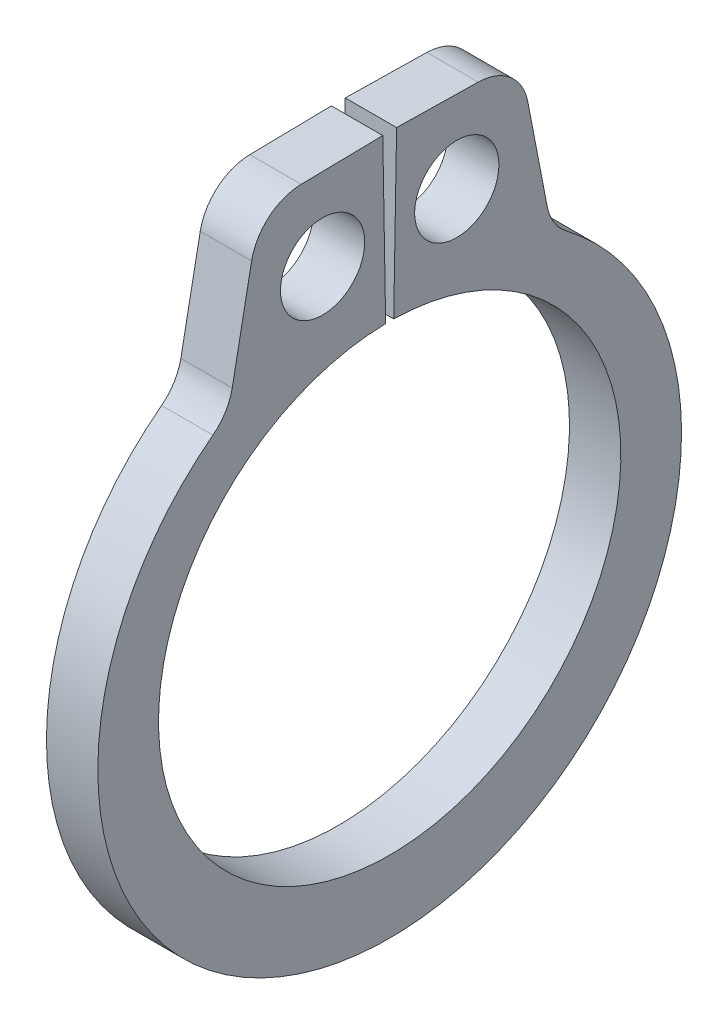
ISO-10303-21;
HEADER;
FILE_DESCRIPTION(('STEP AP214'),'2;1');
FILE_NAME('part.step','',(''),(''),'','','');
FILE_SCHEMA(('AUTOMOTIVE_DESIGN { 1 0 10303 214 1 1 1 1 }'));
ENDSEC;
DATA;
#1=APPLICATION_CONTEXT('core data for automotive mechanical design processes');
#2=APPLICATION_PROTOCOL_DEFINITION('international standard','automotive_design',2000,#1);
#3=PRODUCT_CONTEXT('',#1,'mechanical');
#4=PRODUCT('Part','Part','',(#3));
#5=PRODUCT_RELATED_PRODUCT_CATEGORY('part','',(#4));
#6=PRODUCT_DEFINITION_FORMATION('','',#4);
#7=PRODUCT_DEFINITION_CONTEXT('part definition',#1,'design');
#8=PRODUCT_DEFINITION('design','',#6,#7);
#9=PRODUCT_DEFINITION_SHAPE('','',#8);
#10=(LENGTH_UNIT() NAMED_UNIT(*) SI_UNIT(.MILLI.,.METRE.));
#11=(NAMED_UNIT(*) PLANE_ANGLE_UNIT() SI_UNIT($,.RADIAN.));
#12=(NAMED_UNIT(*) SI_UNIT($,.STERADIAN.) SOLID_ANGLE_UNIT());
#13=UNCERTAINTY_MEASURE_WITH_UNIT(LENGTH_MEASURE(1.E-05),#10,'distance_accuracy_value','');
#14=(GEOMETRIC_REPRESENTATION_CONTEXT(3) GLOBAL_UNCERTAINTY_ASSIGNED_CONTEXT((#13)) GLOBAL_UNIT_ASSIGNED_CONTEXT((#10,
#11,#12)) REPRESENTATION_CONTEXT('',''));
#15=CARTESIAN_POINT('',(0.,0.,0.));
#16=DIRECTION('',(0.,0.,1.));
#17=DIRECTION('',(1.,0.,0.));
#18=AXIS2_PLACEMENT_3D('',#15,#16,#17);
#19=CARTESIAN_POINT('',(0.3175,0.,0.));
#20=DIRECTION('',(1.,0.,0.));
#21=DIRECTION('',(0.,0.,-1.));
#22=AXIS2_PLACEMENT_3D('',#19,#20,#21);
#23=PLANE('',#22);
#24=CARTESIAN_POINT('',(0.3175,3.85961131348306,0.829485840043991));
#25=DIRECTION('',(1.,0.,0.));
#26=DIRECTION('',(0.,0.,-1.));
#27=AXIS2_PLACEMENT_3D('',#24,#25,#26);
#28=CIRCLE('',#27,0.5207);
#29=CARTESIAN_POINT('',(0.3175,3.85961131348306,0.308785840043991));
#30=VERTEX_POINT('',#29);
#31=EDGE_CURVE('E224',#30,#30,#28,.T.);
#32=ORIENTED_EDGE('',*,*,#31,.F.);
#33=EDGE_LOOP('',(#32));
#34=FACE_BOUND('',#33,.T.);
#35=DIRECTION('',(0.,-0.017452406437292,0.999847695156391));
#36=VECTOR('',#35,1.);
#37=CARTESIAN_POINT('',(0.3175,4.88875530546717,0.085333541275098));
#38=LINE('',#37,#36);
#39=CARTESIAN_POINT('',(0.3175,4.88875530546717,0.085333541275098));
#40=VERTEX_POINT('',#39);
#41=CARTESIAN_POINT('',(0.3175,4.87114314790031,1.09433337251507));
#42=VERTEX_POINT('',#41);
#43=EDGE_CURVE('E136',#40,#42,#38,.T.);
#44=ORIENTED_EDGE('',*,*,#43,.T.);
#45=CARTESIAN_POINT('',(0.3175,4.236239861476,1.08325109442739));
#46=DIRECTION('',(1.,0.,0.));
#47=DIRECTION('',(0.,0.,-1.));
#48=AXIS2_PLACEMENT_3D('',#45,#46,#47);
#49=CIRCLE('',#48,0.635);
#50=CARTESIAN_POINT('',(0.3175,4.35665257048609,1.7067298667275));
#51=VERTEX_POINT('',#50);
#52=EDGE_CURVE('E177',#42,#51,#49,.T.);
#53=ORIENTED_EDGE('',*,*,#52,.T.);
#54=DIRECTION('',(0.,-0.981856334330881,0.189626313401717));
#55=VECTOR('',#54,1.);
#56=CARTESIAN_POINT('',(0.3175,4.86215783805674,1.60910142869344));
#57=LINE('',#56,#55);
#58=CARTESIAN_POINT('',(0.3175,3.1162207377056,1.94629497136839));
#59=VERTEX_POINT('',#58);
#60=EDGE_CURVE('E216',#51,#59,#57,.T.);
#61=ORIENTED_EDGE('',*,*,#60,.T.);
#62=CARTESIAN_POINT('',(0.3175,3.23663344671569,2.5697737436685));
#63=DIRECTION('',(1.,0.,0.));
#64=DIRECTION('',(0.,0.,-1.));
#65=AXIS2_PLACEMENT_3D('',#62,#63,#64);
#66=CIRCLE('',#65,0.635);
#67=CARTESIAN_POINT('',(0.3175,2.73137951372647,2.18513954966213));
#68=VERTEX_POINT('',#67);
#69=EDGE_CURVE('E184',#59,#68,#66,.F.);
#70=ORIENTED_EDGE('',*,*,#69,.T.);
#71=CARTESIAN_POINT('',(0.3175,-0.139011025651324,0.));
#72=DIRECTION('',(1.,0.,0.));
#73=DIRECTION('',(0.,0.,-1.));
#74=AXIS2_PLACEMENT_3D('',#71,#72,#73);
#75=CIRCLE('',#74,3.60748897434866);
#76=CARTESIAN_POINT('',(0.3175,2.73137951372647,-2.18513954966213));
#77=VERTEX_POINT('',#76);
#78=EDGE_CURVE('E209',#68,#77,#75,.T.);
#79=ORIENTED_EDGE('',*,*,#78,.T.);
#80=CARTESIAN_POINT('',(0.3175,3.23663344671569,-2.5697737436685));
#81=DIRECTION('',(1.,0.,0.));
#82=DIRECTION('',(0.,0.,-1.));
#83=AXIS2_PLACEMENT_3D('',#80,#81,#82);
#84=CIRCLE('',#83,0.635);
#85=CARTESIAN_POINT('',(0.3175,3.1162207377056,-1.94629497136839));
#86=VERTEX_POINT('',#85);
#87=EDGE_CURVE('E11',#77,#86,#84,.F.);
#88=ORIENTED_EDGE('',*,*,#87,.T.);
#89=DIRECTION('',(0.,0.981856334330881,0.189626313401717));
#90=VECTOR('',#89,1.);
#91=CARTESIAN_POINT('',(0.3175,4.86215783805674,-1.60910142869344));
#92=LINE('',#91,#90);
#93=CARTESIAN_POINT('',(0.3175,4.35665257048609,-1.7067298667275));
#94=VERTEX_POINT('',#93);
#95=EDGE_CURVE('E208',#86,#94,#92,.T.);
#96=ORIENTED_EDGE('',*,*,#95,.T.);
#97=CARTESIAN_POINT('',(0.3175,4.236239861476,-1.08325109442739));
#98=DIRECTION('',(1.,0.,0.));
#99=DIRECTION('',(0.,0.,-1.));
#100=AXIS2_PLACEMENT_3D('',#97,#98,#99);
#101=CIRCLE('',#100,0.635);
#102=CARTESIAN_POINT('',(0.3175,4.87114314790031,-1.09433337251507));
#103=VERTEX_POINT('',#102);
#104=EDGE_CURVE('E52',#94,#103,#101,.T.);
#105=ORIENTED_EDGE('',*,*,#104,.T.);
#106=DIRECTION('',(0.,0.017452406437292,0.999847695156391));
#107=VECTOR('',#106,1.);
#108=CARTESIAN_POINT('',(0.3175,4.88875530546717,-0.085333541275098));
#109=LINE('',#108,#107);
#110=CARTESIAN_POINT('',(0.3175,4.88875530546717,-0.085333541275098));
#111=VERTEX_POINT('',#110);
#112=EDGE_CURVE('E213',#103,#111,#109,.T.);
#113=ORIENTED_EDGE('',*,*,#112,.T.);
#114=DIRECTION('',(0.,-0.999847695156391,0.0174524064372837));
#115=VECTOR('',#114,1.);
#116=CARTESIAN_POINT('',(0.3175,2.85706478890939,-0.0498702513945376));
#117=LINE('',#116,#115);
#118=CARTESIAN_POINT('',(0.3175,2.85706478890939,-0.0498702513945376));
#119=VERTEX_POINT('',#118);
#120=EDGE_CURVE('E142',#111,#119,#117,.T.);
#121=ORIENTED_EDGE('',*,*,#120,.T.);
#122=CARTESIAN_POINT('',(0.3175,0.,0.));
#123=DIRECTION('',(-1.,0.,0.));
#124=DIRECTION('',(0.,0.,-1.));
#125=AXIS2_PLACEMENT_3D('',#122,#123,#124);
#126=CIRCLE('',#125,2.8575);
#127=CARTESIAN_POINT('',(0.3175,2.85706478890939,0.0498702513945376));
#128=VERTEX_POINT('',#127);
#129=EDGE_CURVE('E137',#119,#128,#126,.T.);
#130=ORIENTED_EDGE('',*,*,#129,.T.);
#131=DIRECTION('',(0.,0.999847695156391,0.0174524064372837));
#132=VECTOR('',#131,1.);
#133=CARTESIAN_POINT('',(0.3175,2.85706478890939,0.0498702513945376));
#134=LINE('',#133,#132);
#135=EDGE_CURVE('E128',#128,#40,#134,.T.);
#136=ORIENTED_EDGE('',*,*,#135,.T.);
#137=EDGE_LOOP('',(#44,#53,#61,#70,#79,#88,#96,#105,#113,#121,#130,#136));
#138=FACE_BOUND('',#137,.T.);
#139=CARTESIAN_POINT('',(0.3175,3.85961131348306,-0.829485840043991));
#140=DIRECTION('',(1.,0.,0.));
#141=DIRECTION('',(0.,0.,-1.));
#142=AXIS2_PLACEMENT_3D('',#139,#140,#141);
#143=CIRCLE('',#142,0.5207);
#144=CARTESIAN_POINT('',(0.3175,3.85961131348306,-1.35018584004399));
#145=VERTEX_POINT('',#144);
#146=EDGE_CURVE('E250',#145,#145,#143,.T.);
#147=ORIENTED_EDGE('',*,*,#146,.F.);
#148=EDGE_LOOP('',(#147));
#149=FACE_BOUND('',#148,.T.);
#150=ADVANCED_FACE('F37',(#34,#138,#149),#23,.T.);
#151=CARTESIAN_POINT('',(-0.3175,0.,0.));
#152=DIRECTION('',(1.,0.,0.));
#153=DIRECTION('',(0.,0.,-1.));
#154=AXIS2_PLACEMENT_3D('',#151,#152,#153);
#155=PLANE('',#154);
#156=CARTESIAN_POINT('',(-0.3175,3.85961131348306,0.829485840043991));
#157=DIRECTION('',(1.,0.,0.));
#158=DIRECTION('',(0.,0.,-1.));
#159=AXIS2_PLACEMENT_3D('',#156,#157,#158);
#160=CIRCLE('',#159,0.5207);
#161=CARTESIAN_POINT('',(-0.3175,3.85961131348306,0.308785840043991));
#162=VERTEX_POINT('',#161);
#163=EDGE_CURVE('E247',#162,#162,#160,.T.);
#164=ORIENTED_EDGE('',*,*,#163,.T.);
#165=EDGE_LOOP('',(#164));
#166=FACE_BOUND('',#165,.T.);
#167=DIRECTION('',(0.,-0.981856334330881,0.189626313401717));
#168=VECTOR('',#167,1.);
#169=CARTESIAN_POINT('',(-0.3175,4.86215783805674,1.60910142869344));
#170=LINE('',#169,#168);
#171=CARTESIAN_POINT('',(-0.3175,4.35665257048609,1.7067298667275));
#172=VERTEX_POINT('',#171);
#173=CARTESIAN_POINT('',(-0.3175,3.1162207377056,1.94629497136839));
#174=VERTEX_POINT('',#173);
#175=EDGE_CURVE('E203',#172,#174,#170,.T.);
#176=ORIENTED_EDGE('',*,*,#175,.F.);
#177=CARTESIAN_POINT('',(-0.3175,4.236239861476,1.08325109442739));
#178=DIRECTION('',(1.,0.,0.));
#179=DIRECTION('',(0.,0.,-1.));
#180=AXIS2_PLACEMENT_3D('',#177,#178,#179);
#181=CIRCLE('',#180,0.635);
#182=CARTESIAN_POINT('',(-0.3175,4.87114314790031,1.09433337251507));
#183=VERTEX_POINT('',#182);
#184=EDGE_CURVE('E173',#172,#183,#181,.F.);
#185=ORIENTED_EDGE('',*,*,#184,.T.);
#186=DIRECTION('',(0.,-0.017452406437292,0.999847695156391));
#187=VECTOR('',#186,1.);
#188=CARTESIAN_POINT('',(-0.3175,4.88875530546717,0.085333541275098));
#189=LINE('',#188,#187);
#190=CARTESIAN_POINT('',(-0.3175,4.88875530546717,0.085333541275098));
#191=VERTEX_POINT('',#190);
#192=EDGE_CURVE('E226',#191,#183,#189,.T.);
#193=ORIENTED_EDGE('',*,*,#192,.F.);
#194=DIRECTION('',(0.,0.999847695156391,0.0174524064372837));
#195=VECTOR('',#194,1.);
#196=CARTESIAN_POINT('',(-0.3175,2.85706478890939,0.0498702513945376));
#197=LINE('',#196,#195);
#198=CARTESIAN_POINT('',(-0.3175,2.85706478890939,0.0498702513945376));
#199=VERTEX_POINT('',#198);
#200=EDGE_CURVE('E223',#199,#191,#197,.T.);
#201=ORIENTED_EDGE('',*,*,#200,.F.);
#202=CARTESIAN_POINT('',(-0.3175,0.,0.));
#203=DIRECTION('',(-1.,0.,0.));
#204=DIRECTION('',(0.,0.,-1.));
#205=AXIS2_PLACEMENT_3D('',#202,#203,#204);
#206=CIRCLE('',#205,2.8575);
#207=CARTESIAN_POINT('',(-0.3175,2.85706478890939,-0.0498702513945376));
#208=VERTEX_POINT('',#207);
#209=EDGE_CURVE('E150',#208,#199,#206,.T.);
#210=ORIENTED_EDGE('',*,*,#209,.F.);
#211=DIRECTION('',(0.,-0.999847695156391,0.0174524064372837));
#212=VECTOR('',#211,1.);
#213=CARTESIAN_POINT('',(-0.3175,2.85706478890939,-0.0498702513945376));
#214=LINE('',#213,#212);
#215=CARTESIAN_POINT('',(-0.3175,4.88875530546717,-0.085333541275098));
#216=VERTEX_POINT('',#215);
#217=EDGE_CURVE('E146',#216,#208,#214,.T.);
#218=ORIENTED_EDGE('',*,*,#217,.F.);
#219=DIRECTION('',(0.,0.017452406437292,0.999847695156391));
#220=VECTOR('',#219,1.);
#221=CARTESIAN_POINT('',(-0.3175,4.88875530546717,-0.085333541275098));
#222=LINE('',#221,#220);
#223=CARTESIAN_POINT('',(-0.3175,4.87114314790031,-1.09433337251507));
#224=VERTEX_POINT('',#223);
#225=EDGE_CURVE('E231',#224,#216,#222,.T.);
#226=ORIENTED_EDGE('',*,*,#225,.F.);
#227=CARTESIAN_POINT('',(-0.3175,4.236239861476,-1.08325109442739));
#228=DIRECTION('',(1.,0.,0.));
#229=DIRECTION('',(0.,0.,-1.));
#230=AXIS2_PLACEMENT_3D('',#227,#228,#229);
#231=CIRCLE('',#230,0.635);
#232=CARTESIAN_POINT('',(-0.3175,4.35665257048609,-1.7067298667275));
#233=VERTEX_POINT('',#232);
#234=EDGE_CURVE('E171',#224,#233,#231,.F.);
#235=ORIENTED_EDGE('',*,*,#234,.T.);
#236=DIRECTION('',(0.,0.981856334330881,0.189626313401717));
#237=VECTOR('',#236,1.);
#238=CARTESIAN_POINT('',(-0.3175,4.86215783805674,-1.60910142869344));
#239=LINE('',#238,#237);
#240=CARTESIAN_POINT('',(-0.3175,3.1162207377056,-1.94629497136839));
#241=VERTEX_POINT('',#240);
#242=EDGE_CURVE('E194',#241,#233,#239,.T.);
#243=ORIENTED_EDGE('',*,*,#242,.F.);
#244=CARTESIAN_POINT('',(-0.3175,3.23663344671569,-2.5697737436685));
#245=DIRECTION('',(1.,0.,0.));
#246=DIRECTION('',(0.,0.,-1.));
#247=AXIS2_PLACEMENT_3D('',#244,#245,#246);
#248=CIRCLE('',#247,0.635);
#249=CARTESIAN_POINT('',(-0.3175,2.73137951372647,-2.18513954966213));
#250=VERTEX_POINT('',#249);
#251=EDGE_CURVE('E45',#241,#250,#248,.T.);
#252=ORIENTED_EDGE('',*,*,#251,.T.);
#253=CARTESIAN_POINT('',(-0.3175,-0.139011025651324,0.));
#254=DIRECTION('',(1.,0.,0.));
#255=DIRECTION('',(0.,0.,-1.));
#256=AXIS2_PLACEMENT_3D('',#253,#254,#255);
#257=CIRCLE('',#256,3.60748897434866);
#258=CARTESIAN_POINT('',(-0.3175,2.73137951372647,2.18513954966213));
#259=VERTEX_POINT('',#258);
#260=EDGE_CURVE('E192',#259,#250,#257,.T.);
#261=ORIENTED_EDGE('',*,*,#260,.F.);
#262=CARTESIAN_POINT('',(-0.3175,3.23663344671569,2.5697737436685));
#263=DIRECTION('',(1.,0.,0.));
#264=DIRECTION('',(0.,0.,-1.));
#265=AXIS2_PLACEMENT_3D('',#262,#263,#264);
#266=CIRCLE('',#265,0.635);
#267=EDGE_CURVE('E182',#259,#174,#266,.T.);
#268=ORIENTED_EDGE('',*,*,#267,.T.);
#269=EDGE_LOOP('',(#176,#185,#193,#201,#210,#218,#226,#235,#243,#252,#261,#268));
#270=FACE_BOUND('',#269,.T.);
#271=CARTESIAN_POINT('',(-0.3175,3.85961131348306,-0.829485840043991));
#272=DIRECTION('',(1.,0.,0.));
#273=DIRECTION('',(0.,0.,-1.));
#274=AXIS2_PLACEMENT_3D('',#271,#272,#273);
#275=CIRCLE('',#274,0.5207);
#276=CARTESIAN_POINT('',(-0.3175,3.85961131348306,-1.35018584004399));
#277=VERTEX_POINT('',#276);
#278=EDGE_CURVE('E253',#277,#277,#275,.T.);
#279=ORIENTED_EDGE('',*,*,#278,.T.);
#280=EDGE_LOOP('',(#279));
#281=FACE_BOUND('',#280,.T.);
#282=ADVANCED_FACE('F190',(#166,#270,#281),#155,.F.);
#283=CARTESIAN_POINT('',(0.3175,0.,0.));
#284=DIRECTION('',(-1.,0.,0.));
#285=DIRECTION('',(0.,0.,1.));
#286=AXIS2_PLACEMENT_3D('',#283,#284,#285);
#287=CYLINDRICAL_SURFACE('',#286,2.8575);
#288=ORIENTED_EDGE('',*,*,#209,.T.);
#289=DIRECTION('',(-1.,0.,0.));
#290=VECTOR('',#289,1.);
#291=CARTESIAN_POINT('',(0.3175,2.85706478890939,0.0498702513945376));
#292=LINE('',#291,#290);
#293=EDGE_CURVE('E132',#128,#199,#292,.T.);
#294=ORIENTED_EDGE('',*,*,#293,.F.);
#295=ORIENTED_EDGE('',*,*,#129,.F.);
#296=DIRECTION('',(-1.,0.,0.));
#297=VECTOR('',#296,1.);
#298=CARTESIAN_POINT('',(0.3175,2.85706478890939,-0.0498702513945376));
#299=LINE('',#298,#297);
#300=EDGE_CURVE('E221',#119,#208,#299,.T.);
#301=ORIENTED_EDGE('',*,*,#300,.T.);
#302=EDGE_LOOP('',(#288,#294,#295,#301));
#303=FACE_BOUND('',#302,.T.);
#304=ADVANCED_FACE('F148',(#303),#287,.F.);
#305=CARTESIAN_POINT('',(0.3175,2.85706478890939,0.0498702513945376));
#306=DIRECTION('',(0.,-0.0174524064372837,0.999847695156391));
#307=DIRECTION('',(0.,-0.999847695156391,-0.0174524064372837));
#308=AXIS2_PLACEMENT_3D('',#305,#306,#307);
#309=PLANE('',#308);
#310=ORIENTED_EDGE('',*,*,#200,.T.);
#311=DIRECTION('',(-1.,0.,0.));
#312=VECTOR('',#311,1.);
#313=CARTESIAN_POINT('',(0.3175,4.88875530546717,0.085333541275098));
#314=LINE('',#313,#312);
#315=EDGE_CURVE('E135',#40,#191,#314,.T.);
#316=ORIENTED_EDGE('',*,*,#315,.F.);
#317=ORIENTED_EDGE('',*,*,#135,.F.);
#318=ORIENTED_EDGE('',*,*,#293,.T.);
#319=EDGE_LOOP('',(#310,#316,#317,#318));
#320=FACE_BOUND('',#319,.T.);
#321=ADVANCED_FACE('F130',(#320),#309,.F.);
#322=CARTESIAN_POINT('',(0.3175,4.88875530546717,0.085333541275098));
#323=DIRECTION('',(0.,-0.999847695156391,-0.017452406437292));
#324=DIRECTION('',(0.,0.017452406437292,-0.999847695156391));
#325=AXIS2_PLACEMENT_3D('',#322,#323,#324);
#326=PLANE('',#325);
#327=ORIENTED_EDGE('',*,*,#192,.T.);
#328=DIRECTION('',(-1.,0.,0.));
#329=VECTOR('',#328,1.);
#330=CARTESIAN_POINT('',(0.3175,4.87114314790031,1.09433337251507));
#331=LINE('',#330,#329);
#332=EDGE_CURVE('E60',#183,#42,#331,.F.);
#333=ORIENTED_EDGE('',*,*,#332,.T.);
#334=ORIENTED_EDGE('',*,*,#43,.F.);
#335=ORIENTED_EDGE('',*,*,#315,.T.);
#336=EDGE_LOOP('',(#327,#333,#334,#335));
#337=FACE_BOUND('',#336,.T.);
#338=ADVANCED_FACE('F242',(#337),#326,.F.);
#339=CARTESIAN_POINT('',(0.3175,4.86215783805674,1.60910142869344));
#340=DIRECTION('',(0.,-0.189626313401717,-0.98185633433088));
#341=DIRECTION('',(0.,0.981856334330881,-0.189626313401717));
#342=AXIS2_PLACEMENT_3D('',#339,#340,#341);
#343=PLANE('',#342);
#344=ORIENTED_EDGE('',*,*,#175,.T.);
#345=DIRECTION('',(1.,0.,0.));
#346=VECTOR('',#345,1.);
#347=CARTESIAN_POINT('',(0.3175,3.1162207377056,1.94629497136839));
#348=LINE('',#347,#346);
#349=EDGE_CURVE('E164',#174,#59,#348,.T.);
#350=ORIENTED_EDGE('',*,*,#349,.T.);
#351=ORIENTED_EDGE('',*,*,#60,.F.);
#352=DIRECTION('',(-1.,0.,0.));
#353=VECTOR('',#352,1.);
#354=CARTESIAN_POINT('',(0.3175,4.35665257048609,1.7067298667275));
#355=LINE('',#354,#353);
#356=EDGE_CURVE('E161',#51,#172,#355,.T.);
#357=ORIENTED_EDGE('',*,*,#356,.T.);
#358=EDGE_LOOP('',(#344,#350,#351,#357));
#359=FACE_BOUND('',#358,.T.);
#360=ADVANCED_FACE('F283',(#359),#343,.F.);
#361=CARTESIAN_POINT('',(0.3175,-0.139011025651324,0.));
#362=DIRECTION('',(-1.,0.,0.));
#363=DIRECTION('',(0.,0.,1.));
#364=AXIS2_PLACEMENT_3D('',#361,#362,#363);
#365=CYLINDRICAL_SURFACE('',#364,3.60748897434866);
#366=ORIENTED_EDGE('',*,*,#78,.F.);
#367=DIRECTION('',(-1.,0.,0.));
#368=VECTOR('',#367,1.);
#369=CARTESIAN_POINT('',(0.3175,2.73137951372647,2.18513954966213));
#370=LINE('',#369,#368);
#371=EDGE_CURVE('E153',#68,#259,#370,.T.);
#372=ORIENTED_EDGE('',*,*,#371,.T.);
#373=ORIENTED_EDGE('',*,*,#260,.T.);
#374=DIRECTION('',(-1.,0.,0.));
#375=VECTOR('',#374,1.);
#376=CARTESIAN_POINT('',(0.3175,2.73137951372647,-2.18513954966213));
#377=LINE('',#376,#375);
#378=EDGE_CURVE('E151',#250,#77,#377,.F.);
#379=ORIENTED_EDGE('',*,*,#378,.T.);
#380=EDGE_LOOP('',(#366,#372,#373,#379));
#381=FACE_BOUND('',#380,.T.);
#382=ADVANCED_FACE('F200',(#381),#365,.T.);
#383=CARTESIAN_POINT('',(0.3175,4.86215783805674,-1.60910142869344));
#384=DIRECTION('',(0.,-0.189626313401717,0.98185633433088));
#385=DIRECTION('',(0.,-0.981856334330881,-0.189626313401717));
#386=AXIS2_PLACEMENT_3D('',#383,#384,#385);
#387=PLANE('',#386);
#388=ORIENTED_EDGE('',*,*,#95,.F.);
#389=DIRECTION('',(1.,0.,0.));
#390=VECTOR('',#389,1.);
#391=CARTESIAN_POINT('',(-0.3175,3.1162207377056,-1.94629497136839));
#392=LINE('',#391,#390);
#393=EDGE_CURVE('E168',#86,#241,#392,.F.);
#394=ORIENTED_EDGE('',*,*,#393,.T.);
#395=ORIENTED_EDGE('',*,*,#242,.T.);
#396=DIRECTION('',(-1.,0.,0.));
#397=VECTOR('',#396,1.);
#398=CARTESIAN_POINT('',(0.3175,4.35665257048609,-1.7067298667275));
#399=LINE('',#398,#397);
#400=EDGE_CURVE('E166',#233,#94,#399,.F.);
#401=ORIENTED_EDGE('',*,*,#400,.T.);
#402=EDGE_LOOP('',(#388,#394,#395,#401));
#403=FACE_BOUND('',#402,.T.);
#404=ADVANCED_FACE('F211',(#403),#387,.F.);
#405=CARTESIAN_POINT('',(0.3175,4.88875530546717,-0.085333541275098));
#406=DIRECTION('',(0.,-0.999847695156391,0.017452406437292));
#407=DIRECTION('',(0.,-0.017452406437292,-0.999847695156391));
#408=AXIS2_PLACEMENT_3D('',#405,#406,#407);
#409=PLANE('',#408);
#410=ORIENTED_EDGE('',*,*,#112,.F.);
#411=DIRECTION('',(-1.,0.,0.));
#412=VECTOR('',#411,1.);
#413=CARTESIAN_POINT('',(0.3175,4.87114314790031,-1.09433337251507));
#414=LINE('',#413,#412);
#415=EDGE_CURVE('E179',#103,#224,#414,.T.);
#416=ORIENTED_EDGE('',*,*,#415,.T.);
#417=ORIENTED_EDGE('',*,*,#225,.T.);
#418=DIRECTION('',(-1.,0.,0.));
#419=VECTOR('',#418,1.);
#420=CARTESIAN_POINT('',(0.3175,4.88875530546717,-0.085333541275098));
#421=LINE('',#420,#419);
#422=EDGE_CURVE('E155',#111,#216,#421,.T.);
#423=ORIENTED_EDGE('',*,*,#422,.F.);
#424=EDGE_LOOP('',(#410,#416,#417,#423));
#425=FACE_BOUND('',#424,.T.);
#426=ADVANCED_FACE('F276',(#425),#409,.F.);
#427=CARTESIAN_POINT('',(0.3175,2.85706478890939,-0.0498702513945376));
#428=DIRECTION('',(0.,-0.0174524064372837,-0.999847695156391));
#429=DIRECTION('',(0.,0.999847695156391,-0.0174524064372837));
#430=AXIS2_PLACEMENT_3D('',#427,#428,#429);
#431=PLANE('',#430);
#432=ORIENTED_EDGE('',*,*,#217,.T.);
#433=ORIENTED_EDGE('',*,*,#300,.F.);
#434=ORIENTED_EDGE('',*,*,#120,.F.);
#435=ORIENTED_EDGE('',*,*,#422,.T.);
#436=EDGE_LOOP('',(#432,#433,#434,#435));
#437=FACE_BOUND('',#436,.T.);
#438=ADVANCED_FACE('F238',(#437),#431,.F.);
#439=CARTESIAN_POINT('',(0.3175,3.85961131348306,0.829485840043991));
#440=DIRECTION('',(-1.,0.,0.));
#441=DIRECTION('',(0.,0.,1.));
#442=AXIS2_PLACEMENT_3D('',#439,#440,#441);
#443=CYLINDRICAL_SURFACE('',#442,0.5207);
#444=ORIENTED_EDGE('',*,*,#31,.T.);
#445=EDGE_LOOP('',(#444));
#446=FACE_BOUND('',#445,.T.);
#447=ORIENTED_EDGE('',*,*,#163,.F.);
#448=EDGE_LOOP('',(#447));
#449=FACE_BOUND('',#448,.T.);
#450=ADVANCED_FACE('F271',(#446,#449),#443,.F.);
#451=CARTESIAN_POINT('',(0.3175,3.85961131348306,-0.829485840043991));
#452=DIRECTION('',(-1.,0.,0.));
#453=DIRECTION('',(0.,0.,1.));
#454=AXIS2_PLACEMENT_3D('',#451,#452,#453);
#455=CYLINDRICAL_SURFACE('',#454,0.5207);
#456=ORIENTED_EDGE('',*,*,#146,.T.);
#457=EDGE_LOOP('',(#456));
#458=FACE_BOUND('',#457,.T.);
#459=ORIENTED_EDGE('',*,*,#278,.F.);
#460=EDGE_LOOP('',(#459));
#461=FACE_BOUND('',#460,.T.);
#462=ADVANCED_FACE('F259',(#458,#461),#455,.F.);
#463=CARTESIAN_POINT('',(0.3175,3.23663344671569,2.5697737436685));
#464=DIRECTION('',(-1.,0.,0.));
#465=DIRECTION('',(0.,0.,1.));
#466=AXIS2_PLACEMENT_3D('',#463,#464,#465);
#467=CYLINDRICAL_SURFACE('',#466,0.635);
#468=ORIENTED_EDGE('',*,*,#69,.F.);
#469=ORIENTED_EDGE('',*,*,#349,.F.);
#470=ORIENTED_EDGE('',*,*,#267,.F.);
#471=ORIENTED_EDGE('',*,*,#371,.F.);
#472=EDGE_LOOP('',(#468,#469,#470,#471));
#473=FACE_BOUND('',#472,.T.);
#474=ADVANCED_FACE('F293',(#473),#467,.F.);
#475=CARTESIAN_POINT('',(0.3175,3.23663344671569,-2.5697737436685));
#476=DIRECTION('',(-1.,0.,0.));
#477=DIRECTION('',(0.,0.,1.));
#478=AXIS2_PLACEMENT_3D('',#475,#476,#477);
#479=CYLINDRICAL_SURFACE('',#478,0.635);
#480=ORIENTED_EDGE('',*,*,#87,.F.);
#481=ORIENTED_EDGE('',*,*,#378,.F.);
#482=ORIENTED_EDGE('',*,*,#251,.F.);
#483=ORIENTED_EDGE('',*,*,#393,.F.);
#484=EDGE_LOOP('',(#480,#481,#482,#483));
#485=FACE_BOUND('',#484,.T.);
#486=ADVANCED_FACE('F206',(#485),#479,.F.);
#487=CARTESIAN_POINT('',(0.3175,4.236239861476,1.08325109442739));
#488=DIRECTION('',(-1.,0.,0.));
#489=DIRECTION('',(0.,0.,1.));
#490=AXIS2_PLACEMENT_3D('',#487,#488,#489);
#491=CYLINDRICAL_SURFACE('',#490,0.635);
#492=ORIENTED_EDGE('',*,*,#52,.F.);
#493=ORIENTED_EDGE('',*,*,#332,.F.);
#494=ORIENTED_EDGE('',*,*,#184,.F.);
#495=ORIENTED_EDGE('',*,*,#356,.F.);
#496=EDGE_LOOP('',(#492,#493,#494,#495));
#497=FACE_BOUND('',#496,.T.);
#498=ADVANCED_FACE('F298',(#497),#491,.T.);
#499=CARTESIAN_POINT('',(0.3175,4.236239861476,-1.08325109442739));
#500=DIRECTION('',(-1.,0.,0.));
#501=DIRECTION('',(0.,0.,1.));
#502=AXIS2_PLACEMENT_3D('',#499,#500,#501);
#503=CYLINDRICAL_SURFACE('',#502,0.635);
#504=ORIENTED_EDGE('',*,*,#104,.F.);
#505=ORIENTED_EDGE('',*,*,#400,.F.);
#506=ORIENTED_EDGE('',*,*,#234,.F.);
#507=ORIENTED_EDGE('',*,*,#415,.F.);
#508=EDGE_LOOP('',(#504,#505,#506,#507));
#509=FACE_BOUND('',#508,.T.);
#510=ADVANCED_FACE('F39',(#509),#503,.T.);
#511=CLOSED_SHELL('',(#150,#282,#304,#321,#338,#360,#382,#404,#426,#438,#450,#462,#474,#486,
#498,#510));
#512=MANIFOLD_SOLID_BREP('B2',#511);
#513=ADVANCED_BREP_SHAPE_REPRESENTATION('',(#18,#512),#14);
#514=SHAPE_DEFINITION_REPRESENTATION(#9,#513);
ENDSEC;
END-ISO-10303-21;
